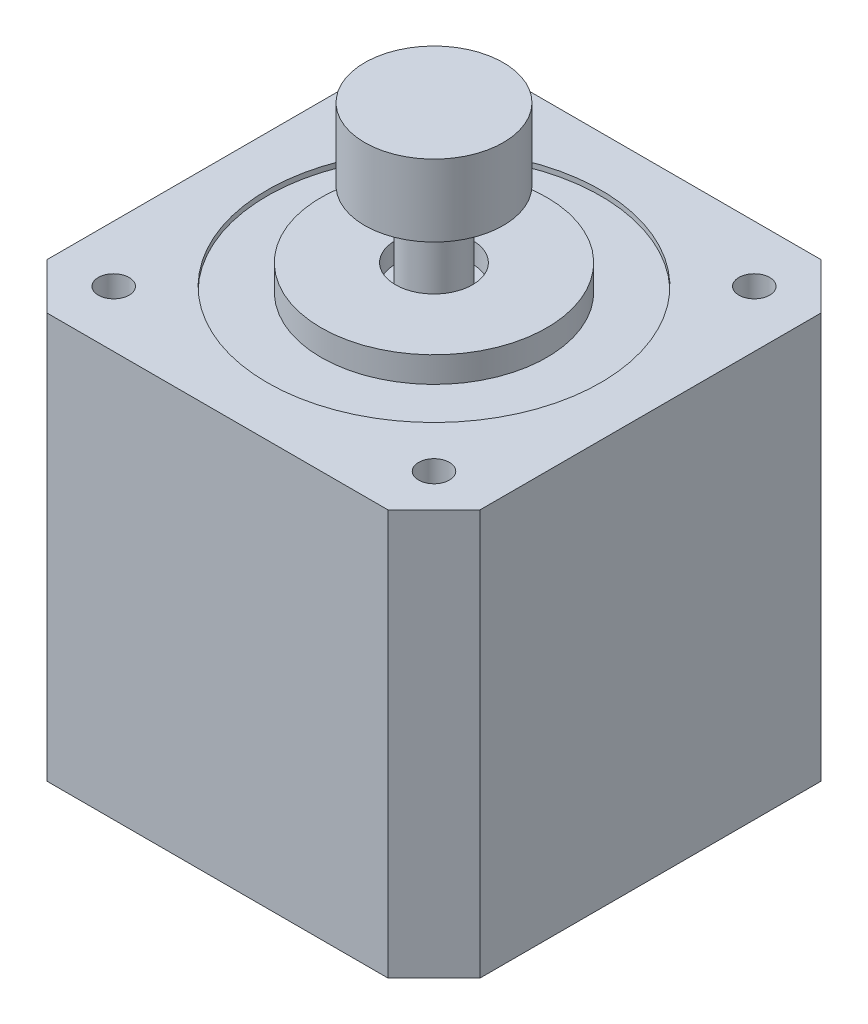
ISO-10303-21;
HEADER;
FILE_DESCRIPTION(('STEP AP214'),'2;1');
FILE_NAME('part.step','',(''),(''),'','','');
FILE_SCHEMA(('AUTOMOTIVE_DESIGN { 1 0 10303 214 1 1 1 1 }'));
ENDSEC;
DATA;
#1=APPLICATION_CONTEXT('core data for automotive mechanical design processes');
#2=APPLICATION_PROTOCOL_DEFINITION('international standard','automotive_design',2000,#1);
#3=PRODUCT_CONTEXT('',#1,'mechanical');
#4=PRODUCT('Part','Part','',(#3));
#5=PRODUCT_RELATED_PRODUCT_CATEGORY('part','',(#4));
#6=PRODUCT_DEFINITION_FORMATION('','',#4);
#7=PRODUCT_DEFINITION_CONTEXT('part definition',#1,'design');
#8=PRODUCT_DEFINITION('design','',#6,#7);
#9=PRODUCT_DEFINITION_SHAPE('','',#8);
#10=(LENGTH_UNIT() NAMED_UNIT(*) SI_UNIT(.MILLI.,.METRE.));
#11=(NAMED_UNIT(*) PLANE_ANGLE_UNIT() SI_UNIT($,.RADIAN.));
#12=(NAMED_UNIT(*) SI_UNIT($,.STERADIAN.) SOLID_ANGLE_UNIT());
#13=UNCERTAINTY_MEASURE_WITH_UNIT(LENGTH_MEASURE(1.E-05),#10,'distance_accuracy_value','');
#14=(GEOMETRIC_REPRESENTATION_CONTEXT(3) GLOBAL_UNCERTAINTY_ASSIGNED_CONTEXT((#13)) GLOBAL_UNIT_ASSIGNED_CONTEXT((#10,
#11,#12)) REPRESENTATION_CONTEXT('',''));
#15=CARTESIAN_POINT('',(0.,0.,0.));
#16=DIRECTION('',(0.,0.,1.));
#17=DIRECTION('',(1.,0.,0.));
#18=AXIS2_PLACEMENT_3D('',#15,#16,#17);
#19=CARTESIAN_POINT('',(0.,55.,0.));
#20=DIRECTION('',(0.,-1.,0.));
#21=DIRECTION('',(0.,0.,-1.));
#22=AXIS2_PLACEMENT_3D('',#19,#20,#21);
#23=CYLINDRICAL_SURFACE('',#22,2.75);
#24=CARTESIAN_POINT('',(0.,39.5,0.));
#25=DIRECTION('',(0.,1.,0.));
#26=DIRECTION('',(0.,0.,1.));
#27=AXIS2_PLACEMENT_3D('',#24,#25,#26);
#28=CIRCLE('',#27,2.75);
#29=CARTESIAN_POINT('',(0.,39.5,2.75));
#30=VERTEX_POINT('',#29);
#31=EDGE_CURVE('E199',#30,#30,#28,.T.);
#32=ORIENTED_EDGE('',*,*,#31,.T.);
#33=EDGE_LOOP('',(#32));
#34=FACE_BOUND('',#33,.T.);
#35=CARTESIAN_POINT('',(0.,48.,0.));
#36=DIRECTION('',(0.,1.,0.));
#37=DIRECTION('',(0.,0.,1.));
#38=AXIS2_PLACEMENT_3D('',#35,#36,#37);
#39=CIRCLE('',#38,2.75);
#40=CARTESIAN_POINT('',(0.,48.,2.75));
#41=VERTEX_POINT('',#40);
#42=EDGE_CURVE('E39',#41,#41,#39,.F.);
#43=ORIENTED_EDGE('',*,*,#42,.T.);
#44=EDGE_LOOP('',(#43));
#45=FACE_BOUND('',#44,.T.);
#46=ADVANCED_FACE('F35',(#34,#45),#23,.T.);
#47=CARTESIAN_POINT('',(0.,41.5,0.));
#48=DIRECTION('',(0.,1.,0.));
#49=DIRECTION('',(0.,0.,1.));
#50=AXIS2_PLACEMENT_3D('',#47,#48,#49);
#51=PLANE('',#50);
#52=CARTESIAN_POINT('',(0.,41.5,0.));
#53=DIRECTION('',(0.,1.,0.));
#54=DIRECTION('',(0.,0.,1.));
#55=AXIS2_PLACEMENT_3D('',#52,#53,#54);
#56=CIRCLE('',#55,11.);
#57=CARTESIAN_POINT('',(0.,41.5,11.));
#58=VERTEX_POINT('',#57);
#59=EDGE_CURVE('E137',#58,#58,#56,.T.);
#60=ORIENTED_EDGE('',*,*,#59,.T.);
#61=EDGE_LOOP('',(#60));
#62=FACE_BOUND('',#61,.T.);
#63=CARTESIAN_POINT('',(0.,41.5,0.));
#64=DIRECTION('',(0.,1.,0.));
#65=DIRECTION('',(0.,0.,1.));
#66=AXIS2_PLACEMENT_3D('',#63,#64,#65);
#67=CIRCLE('',#66,3.75);
#68=CARTESIAN_POINT('',(0.,41.5,3.75));
#69=VERTEX_POINT('',#68);
#70=EDGE_CURVE('E184',#69,#69,#67,.T.);
#71=ORIENTED_EDGE('',*,*,#70,.F.);
#72=EDGE_LOOP('',(#71));
#73=FACE_BOUND('',#72,.T.);
#74=ADVANCED_FACE('F276',(#62,#73),#51,.T.);
#75=CARTESIAN_POINT('',(0.,41.5,0.));
#76=DIRECTION('',(0.,-1.,0.));
#77=DIRECTION('',(0.,0.,-1.));
#78=AXIS2_PLACEMENT_3D('',#75,#76,#77);
#79=CYLINDRICAL_SURFACE('',#78,11.);
#80=ORIENTED_EDGE('',*,*,#59,.F.);
#81=EDGE_LOOP('',(#80));
#82=FACE_BOUND('',#81,.T.);
#83=CARTESIAN_POINT('',(0.,39.,0.));
#84=DIRECTION('',(0.,1.,0.));
#85=DIRECTION('',(0.,0.,1.));
#86=AXIS2_PLACEMENT_3D('',#83,#84,#85);
#87=CIRCLE('',#86,11.);
#88=CARTESIAN_POINT('',(0.,39.,11.));
#89=VERTEX_POINT('',#88);
#90=EDGE_CURVE('E194',#89,#89,#87,.T.);
#91=ORIENTED_EDGE('',*,*,#90,.T.);
#92=EDGE_LOOP('',(#91));
#93=FACE_BOUND('',#92,.T.);
#94=ADVANCED_FACE('F283',(#82,#93),#79,.T.);
#95=CARTESIAN_POINT('',(0.,41.5,0.));
#96=DIRECTION('',(0.,-1.,0.));
#97=DIRECTION('',(0.,0.,-1.));
#98=AXIS2_PLACEMENT_3D('',#95,#96,#97);
#99=CYLINDRICAL_SURFACE('',#98,3.75);
#100=ORIENTED_EDGE('',*,*,#70,.T.);
#101=EDGE_LOOP('',(#100));
#102=FACE_BOUND('',#101,.T.);
#103=CARTESIAN_POINT('',(0.,39.5,0.));
#104=DIRECTION('',(0.,1.,0.));
#105=DIRECTION('',(0.,0.,1.));
#106=AXIS2_PLACEMENT_3D('',#103,#104,#105);
#107=CIRCLE('',#106,3.75);
#108=CARTESIAN_POINT('',(0.,39.5,3.75));
#109=VERTEX_POINT('',#108);
#110=EDGE_CURVE('E185',#109,#109,#107,.T.);
#111=ORIENTED_EDGE('',*,*,#110,.F.);
#112=EDGE_LOOP('',(#111));
#113=FACE_BOUND('',#112,.T.);
#114=ADVANCED_FACE('F359',(#102,#113),#99,.F.);
#115=CARTESIAN_POINT('',(0.,39.5,0.));
#116=DIRECTION('',(0.,1.,0.));
#117=DIRECTION('',(0.,0.,1.));
#118=AXIS2_PLACEMENT_3D('',#115,#116,#117);
#119=PLANE('',#118);
#120=ORIENTED_EDGE('',*,*,#31,.F.);
#121=EDGE_LOOP('',(#120));
#122=FACE_BOUND('',#121,.T.);
#123=ORIENTED_EDGE('',*,*,#110,.T.);
#124=EDGE_LOOP('',(#123));
#125=FACE_BOUND('',#124,.T.);
#126=ADVANCED_FACE('F357',(#122,#125),#119,.T.);
#127=CARTESIAN_POINT('',(0.,39.,0.));
#128=DIRECTION('',(0.,1.,0.));
#129=DIRECTION('',(0.,0.,1.));
#130=AXIS2_PLACEMENT_3D('',#127,#128,#129);
#131=CYLINDRICAL_SURFACE('',#130,16.25);
#132=CARTESIAN_POINT('',(0.,39.,0.));
#133=DIRECTION('',(0.,1.,0.));
#134=DIRECTION('',(0.,0.,1.));
#135=AXIS2_PLACEMENT_3D('',#132,#133,#134);
#136=CIRCLE('',#135,16.25);
#137=CARTESIAN_POINT('',(0.,39.,16.25));
#138=VERTEX_POINT('',#137);
#139=EDGE_CURVE('E188',#138,#138,#136,.T.);
#140=ORIENTED_EDGE('',*,*,#139,.F.);
#141=EDGE_LOOP('',(#140));
#142=FACE_BOUND('',#141,.T.);
#143=CARTESIAN_POINT('',(0.,39.5,0.));
#144=DIRECTION('',(0.,1.,0.));
#145=DIRECTION('',(0.,0.,1.));
#146=AXIS2_PLACEMENT_3D('',#143,#144,#145);
#147=CIRCLE('',#146,16.25);
#148=CARTESIAN_POINT('',(0.,39.5,16.25));
#149=VERTEX_POINT('',#148);
#150=EDGE_CURVE('E191',#149,#149,#147,.T.);
#151=ORIENTED_EDGE('',*,*,#150,.T.);
#152=EDGE_LOOP('',(#151));
#153=FACE_BOUND('',#152,.T.);
#154=ADVANCED_FACE('F353',(#142,#153),#131,.F.);
#155=CARTESIAN_POINT('',(0.,39.,0.));
#156=DIRECTION('',(0.,1.,0.));
#157=DIRECTION('',(0.,0.,1.));
#158=AXIS2_PLACEMENT_3D('',#155,#156,#157);
#159=PLANE('',#158);
#160=ORIENTED_EDGE('',*,*,#90,.F.);
#161=EDGE_LOOP('',(#160));
#162=FACE_BOUND('',#161,.T.);
#163=ORIENTED_EDGE('',*,*,#139,.T.);
#164=EDGE_LOOP('',(#163));
#165=FACE_BOUND('',#164,.T.);
#166=ADVANCED_FACE('F350',(#162,#165),#159,.T.);
#167=CARTESIAN_POINT('',(0.,0.,0.));
#168=DIRECTION('',(0.,1.,0.));
#169=DIRECTION('',(0.,0.,1.));
#170=AXIS2_PLACEMENT_3D('',#167,#168,#169);
#171=PLANE('',#170);
#172=CARTESIAN_POINT('',(-15.6,0.,-15.6));
#173=DIRECTION('',(0.,-1.,0.));
#174=DIRECTION('',(0.,0.,-1.));
#175=AXIS2_PLACEMENT_3D('',#172,#173,#174);
#176=CIRCLE('',#175,3.5);
#177=CARTESIAN_POINT('',(-15.6,0.,-19.1));
#178=VERTEX_POINT('',#177);
#179=EDGE_CURVE('E209',#178,#178,#176,.T.);
#180=ORIENTED_EDGE('',*,*,#179,.F.);
#181=EDGE_LOOP('',(#180));
#182=FACE_BOUND('',#181,.T.);
#183=CARTESIAN_POINT('',(15.6,0.,-15.6));
#184=DIRECTION('',(0.,-1.,0.));
#185=DIRECTION('',(0.,0.,-1.));
#186=AXIS2_PLACEMENT_3D('',#183,#184,#185);
#187=CIRCLE('',#186,3.5);
#188=CARTESIAN_POINT('',(15.6,0.,-19.1));
#189=VERTEX_POINT('',#188);
#190=EDGE_CURVE('E216',#189,#189,#187,.T.);
#191=ORIENTED_EDGE('',*,*,#190,.F.);
#192=EDGE_LOOP('',(#191));
#193=FACE_BOUND('',#192,.T.);
#194=CARTESIAN_POINT('',(15.6,0.,15.6));
#195=DIRECTION('',(0.,-1.,0.));
#196=DIRECTION('',(0.,0.,-1.));
#197=AXIS2_PLACEMENT_3D('',#194,#195,#196);
#198=CIRCLE('',#197,3.5);
#199=CARTESIAN_POINT('',(15.6,0.,12.1));
#200=VERTEX_POINT('',#199);
#201=EDGE_CURVE('E222',#200,#200,#198,.T.);
#202=ORIENTED_EDGE('',*,*,#201,.F.);
#203=EDGE_LOOP('',(#202));
#204=FACE_BOUND('',#203,.T.);
#205=CARTESIAN_POINT('',(-15.6,0.,15.6));
#206=DIRECTION('',(0.,-1.,0.));
#207=DIRECTION('',(0.,0.,-1.));
#208=AXIS2_PLACEMENT_3D('',#205,#206,#207);
#209=CIRCLE('',#208,3.5);
#210=CARTESIAN_POINT('',(-15.6,0.,12.1));
#211=VERTEX_POINT('',#210);
#212=EDGE_CURVE('E203',#211,#211,#209,.T.);
#213=ORIENTED_EDGE('',*,*,#212,.F.);
#214=EDGE_LOOP('',(#213));
#215=FACE_BOUND('',#214,.T.);
#216=DIRECTION('',(-1.,0.,0.));
#217=VECTOR('',#216,1.);
#218=CARTESIAN_POINT('',(16.6,0.,-21.1));
#219=LINE('',#218,#217);
#220=CARTESIAN_POINT('',(16.6,0.,-21.1));
#221=VERTEX_POINT('',#220);
#222=CARTESIAN_POINT('',(-16.6,0.,-21.1));
#223=VERTEX_POINT('',#222);
#224=EDGE_CURVE('E133',#221,#223,#219,.T.);
#225=ORIENTED_EDGE('',*,*,#224,.F.);
#226=DIRECTION('',(-0.707106781186547,0.,-0.707106781186547));
#227=VECTOR('',#226,1.);
#228=CARTESIAN_POINT('',(21.1,0.,-16.6));
#229=LINE('',#228,#227);
#230=CARTESIAN_POINT('',(21.1,0.,-16.6));
#231=VERTEX_POINT('',#230);
#232=EDGE_CURVE('E88',#231,#221,#229,.T.);
#233=ORIENTED_EDGE('',*,*,#232,.F.);
#234=DIRECTION('',(0.,0.,-1.));
#235=VECTOR('',#234,1.);
#236=CARTESIAN_POINT('',(21.1,0.,-16.6));
#237=LINE('',#236,#235);
#238=CARTESIAN_POINT('',(21.1,0.,16.6));
#239=VERTEX_POINT('',#238);
#240=EDGE_CURVE('E82',#239,#231,#237,.T.);
#241=ORIENTED_EDGE('',*,*,#240,.F.);
#242=DIRECTION('',(0.707106781186547,0.,-0.707106781186547));
#243=VECTOR('',#242,1.);
#244=CARTESIAN_POINT('',(21.1,0.,16.6));
#245=LINE('',#244,#243);
#246=CARTESIAN_POINT('',(16.6,0.,21.1));
#247=VERTEX_POINT('',#246);
#248=EDGE_CURVE('E123',#247,#239,#245,.T.);
#249=ORIENTED_EDGE('',*,*,#248,.F.);
#250=DIRECTION('',(1.,0.,0.));
#251=VECTOR('',#250,1.);
#252=CARTESIAN_POINT('',(16.6,0.,21.1));
#253=LINE('',#252,#251);
#254=CARTESIAN_POINT('',(-16.6,0.,21.1));
#255=VERTEX_POINT('',#254);
#256=EDGE_CURVE('E143',#255,#247,#253,.T.);
#257=ORIENTED_EDGE('',*,*,#256,.F.);
#258=DIRECTION('',(0.707106781186548,0.,0.707106781186547));
#259=VECTOR('',#258,1.);
#260=CARTESIAN_POINT('',(-16.6,0.,21.1));
#261=LINE('',#260,#259);
#262=CARTESIAN_POINT('',(-21.1,0.,16.6));
#263=VERTEX_POINT('',#262);
#264=EDGE_CURVE('E141',#263,#255,#261,.T.);
#265=ORIENTED_EDGE('',*,*,#264,.F.);
#266=DIRECTION('',(0.,0.,1.));
#267=VECTOR('',#266,1.);
#268=CARTESIAN_POINT('',(-21.1,0.,-16.6));
#269=LINE('',#268,#267);
#270=CARTESIAN_POINT('',(-21.1,0.,-16.6));
#271=VERTEX_POINT('',#270);
#272=EDGE_CURVE('E139',#271,#263,#269,.T.);
#273=ORIENTED_EDGE('',*,*,#272,.F.);
#274=DIRECTION('',(-0.707106781186547,0.,0.707106781186547));
#275=VECTOR('',#274,1.);
#276=CARTESIAN_POINT('',(-16.6,0.,-21.1));
#277=LINE('',#276,#275);
#278=EDGE_CURVE('E136',#223,#271,#277,.T.);
#279=ORIENTED_EDGE('',*,*,#278,.F.);
#280=EDGE_LOOP('',(#225,#233,#241,#249,#257,#265,#273,#279));
#281=FACE_BOUND('',#280,.T.);
#282=ADVANCED_FACE('F168',(#182,#193,#204,#215,#281),#171,.F.);
#283=CARTESIAN_POINT('',(21.1,39.5,-16.6));
#284=DIRECTION('',(-0.707106781186547,0.,0.707106781186547));
#285=DIRECTION('',(0.707106781186548,0.,0.707106781186548));
#286=AXIS2_PLACEMENT_3D('',#283,#284,#285);
#287=PLANE('',#286);
#288=ORIENTED_EDGE('',*,*,#232,.T.);
#289=DIRECTION('',(0.,-1.,0.));
#290=VECTOR('',#289,1.);
#291=CARTESIAN_POINT('',(16.6,39.5,-21.1));
#292=LINE('',#291,#290);
#293=CARTESIAN_POINT('',(16.6,39.5,-21.1));
#294=VERTEX_POINT('',#293);
#295=EDGE_CURVE('E129',#294,#221,#292,.T.);
#296=ORIENTED_EDGE('',*,*,#295,.F.);
#297=DIRECTION('',(-0.707106781186547,0.,-0.707106781186547));
#298=VECTOR('',#297,1.);
#299=CARTESIAN_POINT('',(21.1,39.5,-16.6));
#300=LINE('',#299,#298);
#301=CARTESIAN_POINT('',(21.1,39.5,-16.6));
#302=VERTEX_POINT('',#301);
#303=EDGE_CURVE('E53',#302,#294,#300,.T.);
#304=ORIENTED_EDGE('',*,*,#303,.F.);
#305=DIRECTION('',(0.,-1.,0.));
#306=VECTOR('',#305,1.);
#307=CARTESIAN_POINT('',(21.1,39.5,-16.6));
#308=LINE('',#307,#306);
#309=EDGE_CURVE('E125',#302,#231,#308,.T.);
#310=ORIENTED_EDGE('',*,*,#309,.T.);
#311=EDGE_LOOP('',(#288,#296,#304,#310));
#312=FACE_BOUND('',#311,.T.);
#313=ADVANCED_FACE('F371',(#312),#287,.F.);
#314=CARTESIAN_POINT('',(21.1,39.5,-16.6));
#315=DIRECTION('',(-1.,0.,0.));
#316=DIRECTION('',(0.,0.,1.));
#317=AXIS2_PLACEMENT_3D('',#314,#315,#316);
#318=PLANE('',#317);
#319=ORIENTED_EDGE('',*,*,#240,.T.);
#320=ORIENTED_EDGE('',*,*,#309,.F.);
#321=DIRECTION('',(0.,0.,-1.));
#322=VECTOR('',#321,1.);
#323=CARTESIAN_POINT('',(21.1,39.5,-16.6));
#324=LINE('',#323,#322);
#325=CARTESIAN_POINT('',(21.1,39.5,16.6));
#326=VERTEX_POINT('',#325);
#327=EDGE_CURVE('E113',#326,#302,#324,.T.);
#328=ORIENTED_EDGE('',*,*,#327,.F.);
#329=DIRECTION('',(0.,-1.,0.));
#330=VECTOR('',#329,1.);
#331=CARTESIAN_POINT('',(21.1,39.5,16.6));
#332=LINE('',#331,#330);
#333=EDGE_CURVE('E120',#326,#239,#332,.T.);
#334=ORIENTED_EDGE('',*,*,#333,.T.);
#335=EDGE_LOOP('',(#319,#320,#328,#334));
#336=FACE_BOUND('',#335,.T.);
#337=ADVANCED_FACE('F127',(#336),#318,.F.);
#338=CARTESIAN_POINT('',(21.1,39.5,16.6));
#339=DIRECTION('',(-0.707106781186547,0.,-0.707106781186547));
#340=DIRECTION('',(-0.707106781186548,0.,0.707106781186548));
#341=AXIS2_PLACEMENT_3D('',#338,#339,#340);
#342=PLANE('',#341);
#343=ORIENTED_EDGE('',*,*,#248,.T.);
#344=ORIENTED_EDGE('',*,*,#333,.F.);
#345=DIRECTION('',(0.707106781186547,0.,-0.707106781186547));
#346=VECTOR('',#345,1.);
#347=CARTESIAN_POINT('',(21.1,39.5,16.6));
#348=LINE('',#347,#346);
#349=CARTESIAN_POINT('',(16.6,39.5,21.1));
#350=VERTEX_POINT('',#349);
#351=EDGE_CURVE('E109',#350,#326,#348,.T.);
#352=ORIENTED_EDGE('',*,*,#351,.F.);
#353=DIRECTION('',(0.,-1.,0.));
#354=VECTOR('',#353,1.);
#355=CARTESIAN_POINT('',(16.6,39.5,21.1));
#356=LINE('',#355,#354);
#357=EDGE_CURVE('E124',#350,#247,#356,.T.);
#358=ORIENTED_EDGE('',*,*,#357,.T.);
#359=EDGE_LOOP('',(#343,#344,#352,#358));
#360=FACE_BOUND('',#359,.T.);
#361=ADVANCED_FACE('F121',(#360),#342,.F.);
#362=CARTESIAN_POINT('',(16.6,39.5,21.1));
#363=DIRECTION('',(0.,0.,-1.));
#364=DIRECTION('',(-1.,0.,0.));
#365=AXIS2_PLACEMENT_3D('',#362,#363,#364);
#366=PLANE('',#365);
#367=ORIENTED_EDGE('',*,*,#256,.T.);
#368=ORIENTED_EDGE('',*,*,#357,.F.);
#369=DIRECTION('',(1.,0.,0.));
#370=VECTOR('',#369,1.);
#371=CARTESIAN_POINT('',(16.6,39.5,21.1));
#372=LINE('',#371,#370);
#373=CARTESIAN_POINT('',(-16.6,39.5,21.1));
#374=VERTEX_POINT('',#373);
#375=EDGE_CURVE('E115',#374,#350,#372,.T.);
#376=ORIENTED_EDGE('',*,*,#375,.F.);
#377=DIRECTION('',(0.,-1.,0.));
#378=VECTOR('',#377,1.);
#379=CARTESIAN_POINT('',(-16.6,39.5,21.1));
#380=LINE('',#379,#378);
#381=EDGE_CURVE('E152',#374,#255,#380,.T.);
#382=ORIENTED_EDGE('',*,*,#381,.T.);
#383=EDGE_LOOP('',(#367,#368,#376,#382));
#384=FACE_BOUND('',#383,.T.);
#385=ADVANCED_FACE('F175',(#384),#366,.F.);
#386=CARTESIAN_POINT('',(-16.6,39.5,21.1));
#387=DIRECTION('',(0.707106781186547,0.,-0.707106781186548));
#388=DIRECTION('',(-0.707106781186548,0.,-0.707106781186547));
#389=AXIS2_PLACEMENT_3D('',#386,#387,#388);
#390=PLANE('',#389);
#391=ORIENTED_EDGE('',*,*,#264,.T.);
#392=ORIENTED_EDGE('',*,*,#381,.F.);
#393=DIRECTION('',(0.707106781186548,0.,0.707106781186547));
#394=VECTOR('',#393,1.);
#395=CARTESIAN_POINT('',(-16.6,39.5,21.1));
#396=LINE('',#395,#394);
#397=CARTESIAN_POINT('',(-21.1,39.5,16.6));
#398=VERTEX_POINT('',#397);
#399=EDGE_CURVE('E176',#398,#374,#396,.T.);
#400=ORIENTED_EDGE('',*,*,#399,.F.);
#401=DIRECTION('',(0.,-1.,0.));
#402=VECTOR('',#401,1.);
#403=CARTESIAN_POINT('',(-21.1,39.5,16.6));
#404=LINE('',#403,#402);
#405=EDGE_CURVE('E155',#398,#263,#404,.T.);
#406=ORIENTED_EDGE('',*,*,#405,.T.);
#407=EDGE_LOOP('',(#391,#392,#400,#406));
#408=FACE_BOUND('',#407,.T.);
#409=ADVANCED_FACE('F172',(#408),#390,.F.);
#410=CARTESIAN_POINT('',(-21.1,39.5,-16.6));
#411=DIRECTION('',(1.,0.,0.));
#412=DIRECTION('',(0.,0.,-1.));
#413=AXIS2_PLACEMENT_3D('',#410,#411,#412);
#414=PLANE('',#413);
#415=ORIENTED_EDGE('',*,*,#272,.T.);
#416=ORIENTED_EDGE('',*,*,#405,.F.);
#417=DIRECTION('',(0.,0.,1.));
#418=VECTOR('',#417,1.);
#419=CARTESIAN_POINT('',(-21.1,39.5,-16.6));
#420=LINE('',#419,#418);
#421=CARTESIAN_POINT('',(-21.1,39.5,-16.6));
#422=VERTEX_POINT('',#421);
#423=EDGE_CURVE('E164',#422,#398,#420,.T.);
#424=ORIENTED_EDGE('',*,*,#423,.F.);
#425=DIRECTION('',(0.,-1.,0.));
#426=VECTOR('',#425,1.);
#427=CARTESIAN_POINT('',(-21.1,39.5,-16.6));
#428=LINE('',#427,#426);
#429=EDGE_CURVE('E45',#422,#271,#428,.T.);
#430=ORIENTED_EDGE('',*,*,#429,.T.);
#431=EDGE_LOOP('',(#415,#416,#424,#430));
#432=FACE_BOUND('',#431,.T.);
#433=ADVANCED_FACE('F162',(#432),#414,.F.);
#434=CARTESIAN_POINT('',(-16.6,39.5,-21.1));
#435=DIRECTION('',(0.707106781186547,0.,0.707106781186547));
#436=DIRECTION('',(0.707106781186548,0.,-0.707106781186548));
#437=AXIS2_PLACEMENT_3D('',#434,#435,#436);
#438=PLANE('',#437);
#439=ORIENTED_EDGE('',*,*,#278,.T.);
#440=ORIENTED_EDGE('',*,*,#429,.F.);
#441=DIRECTION('',(-0.707106781186547,0.,0.707106781186547));
#442=VECTOR('',#441,1.);
#443=CARTESIAN_POINT('',(-16.6,39.5,-21.1));
#444=LINE('',#443,#442);
#445=CARTESIAN_POINT('',(-16.6,39.5,-21.1));
#446=VERTEX_POINT('',#445);
#447=EDGE_CURVE('E96',#446,#422,#444,.T.);
#448=ORIENTED_EDGE('',*,*,#447,.F.);
#449=DIRECTION('',(0.,-1.,0.));
#450=VECTOR('',#449,1.);
#451=CARTESIAN_POINT('',(-16.6,39.5,-21.1));
#452=LINE('',#451,#450);
#453=EDGE_CURVE('E11',#446,#223,#452,.T.);
#454=ORIENTED_EDGE('',*,*,#453,.T.);
#455=EDGE_LOOP('',(#439,#440,#448,#454));
#456=FACE_BOUND('',#455,.T.);
#457=ADVANCED_FACE('F384',(#456),#438,.F.);
#458=CARTESIAN_POINT('',(16.6,39.5,-21.1));
#459=DIRECTION('',(0.,0.,1.));
#460=DIRECTION('',(1.,0.,0.));
#461=AXIS2_PLACEMENT_3D('',#458,#459,#460);
#462=PLANE('',#461);
#463=ORIENTED_EDGE('',*,*,#224,.T.);
#464=ORIENTED_EDGE('',*,*,#453,.F.);
#465=DIRECTION('',(-1.,0.,0.));
#466=VECTOR('',#465,1.);
#467=CARTESIAN_POINT('',(16.6,39.5,-21.1));
#468=LINE('',#467,#466);
#469=EDGE_CURVE('E148',#294,#446,#468,.T.);
#470=ORIENTED_EDGE('',*,*,#469,.F.);
#471=ORIENTED_EDGE('',*,*,#295,.T.);
#472=EDGE_LOOP('',(#463,#464,#470,#471));
#473=FACE_BOUND('',#472,.T.);
#474=ADVANCED_FACE('F37',(#473),#462,.F.);
#475=CARTESIAN_POINT('',(-15.6,39.5,15.6));
#476=DIRECTION('',(0.,1.,0.));
#477=DIRECTION('',(0.,0.,1.));
#478=AXIS2_PLACEMENT_3D('',#475,#476,#477);
#479=CIRCLE('',#478,1.5);
#480=CARTESIAN_POINT('',(-15.6,39.5,17.1));
#481=VERTEX_POINT('',#480);
#482=EDGE_CURVE('E233',#481,#481,#479,.T.);
#483=ORIENTED_EDGE('',*,*,#482,.F.);
#484=EDGE_LOOP('',(#483));
#485=FACE_BOUND('',#484,.T.);
#486=CARTESIAN_POINT('',(15.6,39.5,15.6));
#487=DIRECTION('',(0.,1.,0.));
#488=DIRECTION('',(0.,0.,1.));
#489=AXIS2_PLACEMENT_3D('',#486,#487,#488);
#490=CIRCLE('',#489,1.5);
#491=CARTESIAN_POINT('',(15.6,39.5,17.1));
#492=VERTEX_POINT('',#491);
#493=EDGE_CURVE('E239',#492,#492,#490,.T.);
#494=ORIENTED_EDGE('',*,*,#493,.F.);
#495=EDGE_LOOP('',(#494));
#496=FACE_BOUND('',#495,.T.);
#497=CARTESIAN_POINT('',(15.6,39.5,-15.6));
#498=DIRECTION('',(0.,1.,0.));
#499=DIRECTION('',(0.,0.,1.));
#500=AXIS2_PLACEMENT_3D('',#497,#498,#499);
#501=CIRCLE('',#500,1.5);
#502=CARTESIAN_POINT('',(15.6,39.5,-14.1));
#503=VERTEX_POINT('',#502);
#504=EDGE_CURVE('E245',#503,#503,#501,.T.);
#505=ORIENTED_EDGE('',*,*,#504,.F.);
#506=EDGE_LOOP('',(#505));
#507=FACE_BOUND('',#506,.T.);
#508=CARTESIAN_POINT('',(-15.6,39.5,-15.6));
#509=DIRECTION('',(0.,1.,0.));
#510=DIRECTION('',(0.,0.,1.));
#511=AXIS2_PLACEMENT_3D('',#508,#509,#510);
#512=CIRCLE('',#511,1.5);
#513=CARTESIAN_POINT('',(-15.6,39.5,-14.1));
#514=VERTEX_POINT('',#513);
#515=EDGE_CURVE('E227',#514,#514,#512,.T.);
#516=ORIENTED_EDGE('',*,*,#515,.F.);
#517=EDGE_LOOP('',(#516));
#518=FACE_BOUND('',#517,.T.);
#519=ORIENTED_EDGE('',*,*,#150,.F.);
#520=EDGE_LOOP('',(#519));
#521=FACE_BOUND('',#520,.T.);
#522=ORIENTED_EDGE('',*,*,#469,.T.);
#523=ORIENTED_EDGE('',*,*,#447,.T.);
#524=ORIENTED_EDGE('',*,*,#423,.T.);
#525=ORIENTED_EDGE('',*,*,#399,.T.);
#526=ORIENTED_EDGE('',*,*,#375,.T.);
#527=ORIENTED_EDGE('',*,*,#351,.T.);
#528=ORIENTED_EDGE('',*,*,#327,.T.);
#529=ORIENTED_EDGE('',*,*,#303,.T.);
#530=EDGE_LOOP('',(#522,#523,#524,#525,#526,#527,#528,#529));
#531=FACE_BOUND('',#530,.T.);
#532=ADVANCED_FACE('F111',(#485,#496,#507,#518,#521,#531),#119,.T.);
#533=CARTESIAN_POINT('',(-15.6,2.,15.6));
#534=DIRECTION('',(0.,-1.,0.));
#535=DIRECTION('',(0.,0.,-1.));
#536=AXIS2_PLACEMENT_3D('',#533,#534,#535);
#537=CYLINDRICAL_SURFACE('',#536,3.5);
#538=CARTESIAN_POINT('',(-15.6,2.,15.6));
#539=DIRECTION('',(0.,-1.,0.));
#540=DIRECTION('',(0.,0.,-1.));
#541=AXIS2_PLACEMENT_3D('',#538,#539,#540);
#542=CIRCLE('',#541,3.5);
#543=CARTESIAN_POINT('',(-15.6,2.,12.1));
#544=VERTEX_POINT('',#543);
#545=EDGE_CURVE('E202',#544,#544,#542,.T.);
#546=ORIENTED_EDGE('',*,*,#545,.F.);
#547=EDGE_LOOP('',(#546));
#548=FACE_BOUND('',#547,.T.);
#549=ORIENTED_EDGE('',*,*,#212,.T.);
#550=EDGE_LOOP('',(#549));
#551=FACE_BOUND('',#550,.T.);
#552=ADVANCED_FACE('F345',(#548,#551),#537,.F.);
#553=CARTESIAN_POINT('',(-15.6,2.,15.6));
#554=DIRECTION('',(0.,-1.,0.));
#555=DIRECTION('',(0.,0.,-1.));
#556=AXIS2_PLACEMENT_3D('',#553,#554,#555);
#557=PLANE('',#556);
#558=ORIENTED_EDGE('',*,*,#545,.T.);
#559=EDGE_LOOP('',(#558));
#560=FACE_BOUND('',#559,.T.);
#561=ADVANCED_FACE('F327',(#560),#557,.T.);
#562=CARTESIAN_POINT('',(15.6,2.,15.6));
#563=DIRECTION('',(0.,-1.,0.));
#564=DIRECTION('',(0.,0.,-1.));
#565=AXIS2_PLACEMENT_3D('',#562,#563,#564);
#566=CYLINDRICAL_SURFACE('',#565,3.5);
#567=CARTESIAN_POINT('',(15.6,2.,15.6));
#568=DIRECTION('',(0.,-1.,0.));
#569=DIRECTION('',(0.,0.,-1.));
#570=AXIS2_PLACEMENT_3D('',#567,#568,#569);
#571=CIRCLE('',#570,3.5);
#572=CARTESIAN_POINT('',(15.6,2.,12.1));
#573=VERTEX_POINT('',#572);
#574=EDGE_CURVE('E206',#573,#573,#571,.T.);
#575=ORIENTED_EDGE('',*,*,#574,.F.);
#576=EDGE_LOOP('',(#575));
#577=FACE_BOUND('',#576,.T.);
#578=ORIENTED_EDGE('',*,*,#201,.T.);
#579=EDGE_LOOP('',(#578));
#580=FACE_BOUND('',#579,.T.);
#581=ADVANCED_FACE('F323',(#577,#580),#566,.F.);
#582=CARTESIAN_POINT('',(15.6,2.,15.6));
#583=DIRECTION('',(0.,-1.,0.));
#584=DIRECTION('',(0.,0.,-1.));
#585=AXIS2_PLACEMENT_3D('',#582,#583,#584);
#586=PLANE('',#585);
#587=ORIENTED_EDGE('',*,*,#574,.T.);
#588=EDGE_LOOP('',(#587));
#589=FACE_BOUND('',#588,.T.);
#590=ADVANCED_FACE('F319',(#589),#586,.T.);
#591=CARTESIAN_POINT('',(15.6,2.,-15.6));
#592=DIRECTION('',(0.,-1.,0.));
#593=DIRECTION('',(0.,0.,-1.));
#594=AXIS2_PLACEMENT_3D('',#591,#592,#593);
#595=CYLINDRICAL_SURFACE('',#594,3.5);
#596=CARTESIAN_POINT('',(15.6,2.,-15.6));
#597=DIRECTION('',(0.,-1.,0.));
#598=DIRECTION('',(0.,0.,-1.));
#599=AXIS2_PLACEMENT_3D('',#596,#597,#598);
#600=CIRCLE('',#599,3.5);
#601=CARTESIAN_POINT('',(15.6,2.,-19.1));
#602=VERTEX_POINT('',#601);
#603=EDGE_CURVE('E219',#602,#602,#600,.T.);
#604=ORIENTED_EDGE('',*,*,#603,.F.);
#605=EDGE_LOOP('',(#604));
#606=FACE_BOUND('',#605,.T.);
#607=ORIENTED_EDGE('',*,*,#190,.T.);
#608=EDGE_LOOP('',(#607));
#609=FACE_BOUND('',#608,.T.);
#610=ADVANCED_FACE('F322',(#606,#609),#595,.F.);
#611=CARTESIAN_POINT('',(15.6,2.,-15.6));
#612=DIRECTION('',(0.,-1.,0.));
#613=DIRECTION('',(0.,0.,-1.));
#614=AXIS2_PLACEMENT_3D('',#611,#612,#613);
#615=PLANE('',#614);
#616=ORIENTED_EDGE('',*,*,#603,.T.);
#617=EDGE_LOOP('',(#616));
#618=FACE_BOUND('',#617,.T.);
#619=ADVANCED_FACE('F329',(#618),#615,.T.);
#620=CARTESIAN_POINT('',(-15.6,2.,-15.6));
#621=DIRECTION('',(0.,-1.,0.));
#622=DIRECTION('',(0.,0.,-1.));
#623=AXIS2_PLACEMENT_3D('',#620,#621,#622);
#624=CYLINDRICAL_SURFACE('',#623,3.5);
#625=CARTESIAN_POINT('',(-15.6,2.,-15.6));
#626=DIRECTION('',(0.,-1.,0.));
#627=DIRECTION('',(0.,0.,-1.));
#628=AXIS2_PLACEMENT_3D('',#625,#626,#627);
#629=CIRCLE('',#628,3.5);
#630=CARTESIAN_POINT('',(-15.6,2.,-19.1));
#631=VERTEX_POINT('',#630);
#632=EDGE_CURVE('E212',#631,#631,#629,.T.);
#633=ORIENTED_EDGE('',*,*,#632,.F.);
#634=EDGE_LOOP('',(#633));
#635=FACE_BOUND('',#634,.T.);
#636=ORIENTED_EDGE('',*,*,#179,.T.);
#637=EDGE_LOOP('',(#636));
#638=FACE_BOUND('',#637,.T.);
#639=ADVANCED_FACE('F332',(#635,#638),#624,.F.);
#640=CARTESIAN_POINT('',(-15.6,2.,-15.6));
#641=DIRECTION('',(0.,-1.,0.));
#642=DIRECTION('',(0.,0.,-1.));
#643=AXIS2_PLACEMENT_3D('',#640,#641,#642);
#644=PLANE('',#643);
#645=ORIENTED_EDGE('',*,*,#632,.T.);
#646=EDGE_LOOP('',(#645));
#647=FACE_BOUND('',#646,.T.);
#648=ADVANCED_FACE('F317',(#647),#644,.T.);
#649=CARTESIAN_POINT('',(-15.6,34.5,-15.6));
#650=DIRECTION('',(0.,1.,0.));
#651=DIRECTION('',(0.,0.,1.));
#652=AXIS2_PLACEMENT_3D('',#649,#650,#651);
#653=CYLINDRICAL_SURFACE('',#652,1.5);
#654=CARTESIAN_POINT('',(-15.6,34.5,-15.6));
#655=DIRECTION('',(0.,1.,0.));
#656=DIRECTION('',(0.,0.,1.));
#657=AXIS2_PLACEMENT_3D('',#654,#655,#656);
#658=CIRCLE('',#657,1.5);
#659=CARTESIAN_POINT('',(-15.6,34.5,-14.1));
#660=VERTEX_POINT('',#659);
#661=EDGE_CURVE('E213',#660,#660,#658,.T.);
#662=ORIENTED_EDGE('',*,*,#661,.F.);
#663=EDGE_LOOP('',(#662));
#664=FACE_BOUND('',#663,.T.);
#665=ORIENTED_EDGE('',*,*,#515,.T.);
#666=EDGE_LOOP('',(#665));
#667=FACE_BOUND('',#666,.T.);
#668=ADVANCED_FACE('F313',(#664,#667),#653,.F.);
#669=CARTESIAN_POINT('',(-15.6,34.5,-15.6));
#670=DIRECTION('',(0.,1.,0.));
#671=DIRECTION('',(0.,0.,1.));
#672=AXIS2_PLACEMENT_3D('',#669,#670,#671);
#673=PLANE('',#672);
#674=ORIENTED_EDGE('',*,*,#661,.T.);
#675=EDGE_LOOP('',(#674));
#676=FACE_BOUND('',#675,.T.);
#677=ADVANCED_FACE('F295',(#676),#673,.T.);
#678=CARTESIAN_POINT('',(15.6,34.5,-15.6));
#679=DIRECTION('',(0.,1.,0.));
#680=DIRECTION('',(0.,0.,1.));
#681=AXIS2_PLACEMENT_3D('',#678,#679,#680);
#682=CYLINDRICAL_SURFACE('',#681,1.5);
#683=CARTESIAN_POINT('',(15.6,34.5,-15.6));
#684=DIRECTION('',(0.,1.,0.));
#685=DIRECTION('',(0.,0.,1.));
#686=AXIS2_PLACEMENT_3D('',#683,#684,#685);
#687=CIRCLE('',#686,1.5);
#688=CARTESIAN_POINT('',(15.6,34.5,-14.1));
#689=VERTEX_POINT('',#688);
#690=EDGE_CURVE('E230',#689,#689,#687,.T.);
#691=ORIENTED_EDGE('',*,*,#690,.F.);
#692=EDGE_LOOP('',(#691));
#693=FACE_BOUND('',#692,.T.);
#694=ORIENTED_EDGE('',*,*,#504,.T.);
#695=EDGE_LOOP('',(#694));
#696=FACE_BOUND('',#695,.T.);
#697=ADVANCED_FACE('F291',(#693,#696),#682,.F.);
#698=CARTESIAN_POINT('',(15.6,34.5,-15.6));
#699=DIRECTION('',(0.,1.,0.));
#700=DIRECTION('',(0.,0.,1.));
#701=AXIS2_PLACEMENT_3D('',#698,#699,#700);
#702=PLANE('',#701);
#703=ORIENTED_EDGE('',*,*,#690,.T.);
#704=EDGE_LOOP('',(#703));
#705=FACE_BOUND('',#704,.T.);
#706=ADVANCED_FACE('F287',(#705),#702,.T.);
#707=CARTESIAN_POINT('',(15.6,34.5,15.6));
#708=DIRECTION('',(0.,1.,0.));
#709=DIRECTION('',(0.,0.,1.));
#710=AXIS2_PLACEMENT_3D('',#707,#708,#709);
#711=CYLINDRICAL_SURFACE('',#710,1.5);
#712=CARTESIAN_POINT('',(15.6,34.5,15.6));
#713=DIRECTION('',(0.,1.,0.));
#714=DIRECTION('',(0.,0.,1.));
#715=AXIS2_PLACEMENT_3D('',#712,#713,#714);
#716=CIRCLE('',#715,1.5);
#717=CARTESIAN_POINT('',(15.6,34.5,17.1));
#718=VERTEX_POINT('',#717);
#719=EDGE_CURVE('E242',#718,#718,#716,.T.);
#720=ORIENTED_EDGE('',*,*,#719,.F.);
#721=EDGE_LOOP('',(#720));
#722=FACE_BOUND('',#721,.T.);
#723=ORIENTED_EDGE('',*,*,#493,.T.);
#724=EDGE_LOOP('',(#723));
#725=FACE_BOUND('',#724,.T.);
#726=ADVANCED_FACE('F290',(#722,#725),#711,.F.);
#727=CARTESIAN_POINT('',(15.6,34.5,15.6));
#728=DIRECTION('',(0.,1.,0.));
#729=DIRECTION('',(0.,0.,1.));
#730=AXIS2_PLACEMENT_3D('',#727,#728,#729);
#731=PLANE('',#730);
#732=ORIENTED_EDGE('',*,*,#719,.T.);
#733=EDGE_LOOP('',(#732));
#734=FACE_BOUND('',#733,.T.);
#735=ADVANCED_FACE('F297',(#734),#731,.T.);
#736=CARTESIAN_POINT('',(-15.6,34.5,15.6));
#737=DIRECTION('',(0.,1.,0.));
#738=DIRECTION('',(0.,0.,1.));
#739=AXIS2_PLACEMENT_3D('',#736,#737,#738);
#740=CYLINDRICAL_SURFACE('',#739,1.5);
#741=CARTESIAN_POINT('',(-15.6,34.5,15.6));
#742=DIRECTION('',(0.,1.,0.));
#743=DIRECTION('',(0.,0.,1.));
#744=AXIS2_PLACEMENT_3D('',#741,#742,#743);
#745=CIRCLE('',#744,1.5);
#746=CARTESIAN_POINT('',(-15.6,34.5,17.1));
#747=VERTEX_POINT('',#746);
#748=EDGE_CURVE('E236',#747,#747,#745,.T.);
#749=ORIENTED_EDGE('',*,*,#748,.F.);
#750=EDGE_LOOP('',(#749));
#751=FACE_BOUND('',#750,.T.);
#752=ORIENTED_EDGE('',*,*,#482,.T.);
#753=EDGE_LOOP('',(#752));
#754=FACE_BOUND('',#753,.T.);
#755=ADVANCED_FACE('F300',(#751,#754),#740,.F.);
#756=CARTESIAN_POINT('',(-15.6,34.5,15.6));
#757=DIRECTION('',(0.,1.,0.));
#758=DIRECTION('',(0.,0.,1.));
#759=AXIS2_PLACEMENT_3D('',#756,#757,#758);
#760=PLANE('',#759);
#761=ORIENTED_EDGE('',*,*,#748,.T.);
#762=EDGE_LOOP('',(#761));
#763=FACE_BOUND('',#762,.T.);
#764=ADVANCED_FACE('F273',(#763),#760,.T.);
#765=CARTESIAN_POINT('',(0.,48.,0.));
#766=DIRECTION('',(0.,1.,0.));
#767=DIRECTION('',(0.,0.,1.));
#768=AXIS2_PLACEMENT_3D('',#765,#766,#767);
#769=CYLINDRICAL_SURFACE('',#768,6.75);
#770=CARTESIAN_POINT('',(0.,48.,0.));
#771=DIRECTION('',(0.,1.,0.));
#772=DIRECTION('',(0.,0.,1.));
#773=AXIS2_PLACEMENT_3D('',#770,#771,#772);
#774=CIRCLE('',#773,6.75);
#775=CARTESIAN_POINT('',(0.,48.,6.75));
#776=VERTEX_POINT('',#775);
#777=EDGE_CURVE('E253',#776,#776,#774,.T.);
#778=ORIENTED_EDGE('',*,*,#777,.T.);
#779=EDGE_LOOP('',(#778));
#780=FACE_BOUND('',#779,.T.);
#781=CARTESIAN_POINT('',(0.,55.,0.));
#782=DIRECTION('',(0.,1.,0.));
#783=DIRECTION('',(0.,0.,1.));
#784=AXIS2_PLACEMENT_3D('',#781,#782,#783);
#785=CIRCLE('',#784,6.75);
#786=CARTESIAN_POINT('',(0.,55.,6.75));
#787=VERTEX_POINT('',#786);
#788=EDGE_CURVE('E250',#787,#787,#785,.T.);
#789=ORIENTED_EDGE('',*,*,#788,.F.);
#790=EDGE_LOOP('',(#789));
#791=FACE_BOUND('',#790,.T.);
#792=ADVANCED_FACE('F265',(#780,#791),#769,.T.);
#793=CARTESIAN_POINT('',(0.,48.,0.));
#794=DIRECTION('',(0.,1.,0.));
#795=DIRECTION('',(0.,0.,1.));
#796=AXIS2_PLACEMENT_3D('',#793,#794,#795);
#797=PLANE('',#796);
#798=ORIENTED_EDGE('',*,*,#42,.F.);
#799=EDGE_LOOP('',(#798));
#800=FACE_BOUND('',#799,.T.);
#801=ORIENTED_EDGE('',*,*,#777,.F.);
#802=EDGE_LOOP('',(#801));
#803=FACE_BOUND('',#802,.T.);
#804=ADVANCED_FACE('F261',(#800,#803),#797,.F.);
#805=CARTESIAN_POINT('',(0.,55.,0.));
#806=DIRECTION('',(0.,-1.,0.));
#807=DIRECTION('',(0.,0.,-1.));
#808=AXIS2_PLACEMENT_3D('',#805,#806,#807);
#809=PLANE('',#808);
#810=ORIENTED_EDGE('',*,*,#788,.T.);
#811=EDGE_LOOP('',(#810));
#812=FACE_BOUND('',#811,.T.);
#813=ADVANCED_FACE('F264',(#812),#809,.F.);
#814=CLOSED_SHELL('',(#46,#74,#94,#114,#126,#154,#166,#282,#313,#337,#361,#385,#409,#433,#457,
#474,#532,#552,#561,#581,#590,#610,#619,#639,#648,#668,#677,#697,#706,#726,#735,#755,#764,#792,
#804,#813));
#815=MANIFOLD_SOLID_BREP('B2',#814);
#816=ADVANCED_BREP_SHAPE_REPRESENTATION('',(#18,#815),#14);
#817=SHAPE_DEFINITION_REPRESENTATION(#9,#816);
ENDSEC;
END-ISO-10303-21;
